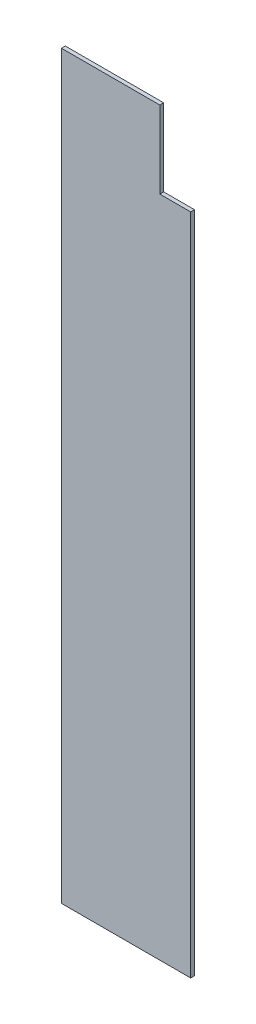
ISO-10303-21;
HEADER;
FILE_DESCRIPTION(('STEP AP214'),'2;1');
FILE_NAME('part.step','',(''),(''),'','','');
FILE_SCHEMA(('AUTOMOTIVE_DESIGN { 1 0 10303 214 1 1 1 1 }'));
ENDSEC;
DATA;
#1=APPLICATION_CONTEXT('core data for automotive mechanical design processes');
#2=APPLICATION_PROTOCOL_DEFINITION('international standard','automotive_design',2000,#1);
#3=PRODUCT_CONTEXT('',#1,'mechanical');
#4=PRODUCT('Part','Part','',(#3));
#5=PRODUCT_RELATED_PRODUCT_CATEGORY('part','',(#4));
#6=PRODUCT_DEFINITION_FORMATION('','',#4);
#7=PRODUCT_DEFINITION_CONTEXT('part definition',#1,'design');
#8=PRODUCT_DEFINITION('design','',#6,#7);
#9=PRODUCT_DEFINITION_SHAPE('','',#8);
#10=(LENGTH_UNIT() NAMED_UNIT(*) SI_UNIT(.MILLI.,.METRE.));
#11=(NAMED_UNIT(*) PLANE_ANGLE_UNIT() SI_UNIT($,.RADIAN.));
#12=(NAMED_UNIT(*) SI_UNIT($,.STERADIAN.) SOLID_ANGLE_UNIT());
#13=UNCERTAINTY_MEASURE_WITH_UNIT(LENGTH_MEASURE(1.E-05),#10,'distance_accuracy_value','');
#14=(GEOMETRIC_REPRESENTATION_CONTEXT(3) GLOBAL_UNCERTAINTY_ASSIGNED_CONTEXT((#13)) GLOBAL_UNIT_ASSIGNED_CONTEXT((#10,
#11,#12)) REPRESENTATION_CONTEXT('',''));
#15=CARTESIAN_POINT('',(0.,0.,0.));
#16=DIRECTION('',(0.,0.,1.));
#17=DIRECTION('',(1.,0.,0.));
#18=AXIS2_PLACEMENT_3D('',#15,#16,#17);
#19=CARTESIAN_POINT('',(168.275000000002,1219.2,6.35));
#20=DIRECTION('',(1.,0.,0.));
#21=DIRECTION('',(0.,0.,-1.));
#22=AXIS2_PLACEMENT_3D('',#19,#20,#21);
#23=PLANE('',#22);
#24=DIRECTION('',(0.,-1.,0.));
#25=VECTOR('',#24,1.);
#26=CARTESIAN_POINT('',(168.275000000002,1219.2,0.));
#27=LINE('',#26,#25);
#28=CARTESIAN_POINT('',(168.275000000002,1219.2,0.));
#29=VERTEX_POINT('',#28);
#30=CARTESIAN_POINT('',(168.275000000002,0.,0.));
#31=VERTEX_POINT('',#30);
#32=EDGE_CURVE('E122',#29,#31,#27,.T.);
#33=ORIENTED_EDGE('',*,*,#32,.T.);
#34=DIRECTION('',(0.,0.,-1.));
#35=VECTOR('',#34,1.);
#36=CARTESIAN_POINT('',(168.275000000002,0.,6.35));
#37=LINE('',#36,#35);
#38=CARTESIAN_POINT('',(168.275000000002,0.,6.35));
#39=VERTEX_POINT('',#38);
#40=EDGE_CURVE('E11',#39,#31,#37,.T.);
#41=ORIENTED_EDGE('',*,*,#40,.F.);
#42=DIRECTION('',(0.,-1.,0.));
#43=VECTOR('',#42,1.);
#44=CARTESIAN_POINT('',(168.275000000002,1219.2,6.35));
#45=LINE('',#44,#43);
#46=CARTESIAN_POINT('',(168.275000000002,1219.2,6.35));
#47=VERTEX_POINT('',#46);
#48=EDGE_CURVE('E132',#47,#39,#45,.T.);
#49=ORIENTED_EDGE('',*,*,#48,.F.);
#50=DIRECTION('',(0.,0.,-1.));
#51=VECTOR('',#50,1.);
#52=CARTESIAN_POINT('',(168.275000000002,1219.2,6.35));
#53=LINE('',#52,#51);
#54=EDGE_CURVE('E118',#47,#29,#53,.T.);
#55=ORIENTED_EDGE('',*,*,#54,.T.);
#56=EDGE_LOOP('',(#33,#41,#49,#55));
#57=FACE_BOUND('',#56,.T.);
#58=ADVANCED_FACE('F38',(#57),#23,.F.);
#59=CARTESIAN_POINT('',(381.000000000002,-2.22044604925031E-13,6.35));
#60=DIRECTION('',(0.,1.,0.));
#61=DIRECTION('',(-1.,0.,0.));
#62=AXIS2_PLACEMENT_3D('',#59,#60,#61);
#63=PLANE('',#62);
#64=DIRECTION('',(1.,0.,0.));
#65=VECTOR('',#64,1.);
#66=CARTESIAN_POINT('',(381.000000000002,-2.22044604925031E-13,0.));
#67=LINE('',#66,#65);
#68=CARTESIAN_POINT('',(381.000000000002,-2.22044604925031E-13,0.));
#69=VERTEX_POINT('',#68);
#70=EDGE_CURVE('E125',#31,#69,#67,.T.);
#71=ORIENTED_EDGE('',*,*,#70,.T.);
#72=DIRECTION('',(0.,0.,-1.));
#73=VECTOR('',#72,1.);
#74=CARTESIAN_POINT('',(381.000000000002,-2.22044604925031E-13,6.35));
#75=LINE('',#74,#73);
#76=CARTESIAN_POINT('',(381.000000000002,-2.22044604925031E-13,6.35));
#77=VERTEX_POINT('',#76);
#78=EDGE_CURVE('E46',#77,#69,#75,.T.);
#79=ORIENTED_EDGE('',*,*,#78,.F.);
#80=DIRECTION('',(1.,0.,0.));
#81=VECTOR('',#80,1.);
#82=CARTESIAN_POINT('',(381.000000000002,-2.22044604925031E-13,6.35));
#83=LINE('',#82,#81);
#84=EDGE_CURVE('E91',#39,#77,#83,.T.);
#85=ORIENTED_EDGE('',*,*,#84,.F.);
#86=ORIENTED_EDGE('',*,*,#40,.T.);
#87=EDGE_LOOP('',(#71,#79,#85,#86));
#88=FACE_BOUND('',#87,.T.);
#89=ADVANCED_FACE('F156',(#88),#63,.F.);
#90=CARTESIAN_POINT('',(381.000000000002,-2.22044604925031E-13,6.35));
#91=DIRECTION('',(-1.,0.,0.));
#92=DIRECTION('',(0.,0.,1.));
#93=AXIS2_PLACEMENT_3D('',#90,#91,#92);
#94=PLANE('',#93);
#95=DIRECTION('',(0.,1.,0.));
#96=VECTOR('',#95,1.);
#97=CARTESIAN_POINT('',(381.000000000002,-2.22044604925031E-13,0.));
#98=LINE('',#97,#96);
#99=CARTESIAN_POINT('',(381.000000000002,1092.2,0.));
#100=VERTEX_POINT('',#99);
#101=EDGE_CURVE('E127',#69,#100,#98,.T.);
#102=ORIENTED_EDGE('',*,*,#101,.T.);
#103=DIRECTION('',(0.,0.,-1.));
#104=VECTOR('',#103,1.);
#105=CARTESIAN_POINT('',(381.000000000002,1092.2,6.35));
#106=LINE('',#105,#104);
#107=CARTESIAN_POINT('',(381.000000000002,1092.2,6.35));
#108=VERTEX_POINT('',#107);
#109=EDGE_CURVE('E113',#108,#100,#106,.T.);
#110=ORIENTED_EDGE('',*,*,#109,.F.);
#111=DIRECTION('',(0.,1.,0.));
#112=VECTOR('',#111,1.);
#113=CARTESIAN_POINT('',(381.000000000002,-2.22044604925031E-13,6.35));
#114=LINE('',#113,#112);
#115=EDGE_CURVE('E104',#77,#108,#114,.T.);
#116=ORIENTED_EDGE('',*,*,#115,.F.);
#117=ORIENTED_EDGE('',*,*,#78,.T.);
#118=EDGE_LOOP('',(#102,#110,#116,#117));
#119=FACE_BOUND('',#118,.T.);
#120=ADVANCED_FACE('F138',(#119),#94,.F.);
#121=CARTESIAN_POINT('',(381.000000000002,1092.2,6.35));
#122=DIRECTION('',(0.,-1.,0.));
#123=DIRECTION('',(0.,0.,-1.));
#124=AXIS2_PLACEMENT_3D('',#121,#122,#123);
#125=PLANE('',#124);
#126=DIRECTION('',(-1.,0.,0.));
#127=VECTOR('',#126,1.);
#128=CARTESIAN_POINT('',(381.000000000002,1092.2,0.));
#129=LINE('',#128,#127);
#130=CARTESIAN_POINT('',(330.200000000002,1092.2,0.));
#131=VERTEX_POINT('',#130);
#132=EDGE_CURVE('E112',#100,#131,#129,.T.);
#133=ORIENTED_EDGE('',*,*,#132,.T.);
#134=DIRECTION('',(0.,0.,-1.));
#135=VECTOR('',#134,1.);
#136=CARTESIAN_POINT('',(330.200000000002,1092.2,6.35));
#137=LINE('',#136,#135);
#138=CARTESIAN_POINT('',(330.200000000002,1092.2,6.35));
#139=VERTEX_POINT('',#138);
#140=EDGE_CURVE('E109',#139,#131,#137,.T.);
#141=ORIENTED_EDGE('',*,*,#140,.F.);
#142=DIRECTION('',(-1.,0.,0.));
#143=VECTOR('',#142,1.);
#144=CARTESIAN_POINT('',(381.000000000002,1092.2,6.35));
#145=LINE('',#144,#143);
#146=EDGE_CURVE('E98',#108,#139,#145,.T.);
#147=ORIENTED_EDGE('',*,*,#146,.F.);
#148=ORIENTED_EDGE('',*,*,#109,.T.);
#149=EDGE_LOOP('',(#133,#141,#147,#148));
#150=FACE_BOUND('',#149,.T.);
#151=ADVANCED_FACE('F110',(#150),#125,.F.);
#152=CARTESIAN_POINT('',(330.200000000002,1219.2,6.35));
#153=DIRECTION('',(-1.,0.,0.));
#154=DIRECTION('',(0.,0.,1.));
#155=AXIS2_PLACEMENT_3D('',#152,#153,#154);
#156=PLANE('',#155);
#157=DIRECTION('',(0.,1.,0.));
#158=VECTOR('',#157,1.);
#159=CARTESIAN_POINT('',(330.200000000002,1219.2,0.));
#160=LINE('',#159,#158);
#161=CARTESIAN_POINT('',(330.200000000002,1219.2,0.));
#162=VERTEX_POINT('',#161);
#163=EDGE_CURVE('E77',#131,#162,#160,.T.);
#164=ORIENTED_EDGE('',*,*,#163,.T.);
#165=DIRECTION('',(0.,0.,-1.));
#166=VECTOR('',#165,1.);
#167=CARTESIAN_POINT('',(330.200000000002,1219.2,6.35));
#168=LINE('',#167,#166);
#169=CARTESIAN_POINT('',(330.200000000002,1219.2,6.35));
#170=VERTEX_POINT('',#169);
#171=EDGE_CURVE('E114',#170,#162,#168,.T.);
#172=ORIENTED_EDGE('',*,*,#171,.F.);
#173=DIRECTION('',(0.,1.,0.));
#174=VECTOR('',#173,1.);
#175=CARTESIAN_POINT('',(330.200000000002,1219.2,6.35));
#176=LINE('',#175,#174);
#177=EDGE_CURVE('E102',#139,#170,#176,.T.);
#178=ORIENTED_EDGE('',*,*,#177,.F.);
#179=ORIENTED_EDGE('',*,*,#140,.T.);
#180=EDGE_LOOP('',(#164,#172,#178,#179));
#181=FACE_BOUND('',#180,.T.);
#182=ADVANCED_FACE('F116',(#181),#156,.F.);
#183=CARTESIAN_POINT('',(168.275000000002,1219.2,6.35));
#184=DIRECTION('',(0.,-1.,0.));
#185=DIRECTION('',(0.,0.,-1.));
#186=AXIS2_PLACEMENT_3D('',#183,#184,#185);
#187=PLANE('',#186);
#188=DIRECTION('',(-1.,0.,0.));
#189=VECTOR('',#188,1.);
#190=CARTESIAN_POINT('',(168.275000000002,1219.2,0.));
#191=LINE('',#190,#189);
#192=EDGE_CURVE('E83',#162,#29,#191,.T.);
#193=ORIENTED_EDGE('',*,*,#192,.T.);
#194=ORIENTED_EDGE('',*,*,#54,.F.);
#195=DIRECTION('',(-1.,0.,0.));
#196=VECTOR('',#195,1.);
#197=CARTESIAN_POINT('',(168.275000000002,1219.2,6.35));
#198=LINE('',#197,#196);
#199=EDGE_CURVE('E54',#170,#47,#198,.T.);
#200=ORIENTED_EDGE('',*,*,#199,.F.);
#201=ORIENTED_EDGE('',*,*,#171,.T.);
#202=EDGE_LOOP('',(#193,#194,#200,#201));
#203=FACE_BOUND('',#202,.T.);
#204=ADVANCED_FACE('F145',(#203),#187,.F.);
#205=CARTESIAN_POINT('',(0.,0.,6.35));
#206=DIRECTION('',(0.,0.,-1.));
#207=DIRECTION('',(-1.,0.,0.));
#208=AXIS2_PLACEMENT_3D('',#205,#206,#207);
#209=PLANE('',#208);
#210=ORIENTED_EDGE('',*,*,#48,.T.);
#211=ORIENTED_EDGE('',*,*,#84,.T.);
#212=ORIENTED_EDGE('',*,*,#115,.T.);
#213=ORIENTED_EDGE('',*,*,#146,.T.);
#214=ORIENTED_EDGE('',*,*,#177,.T.);
#215=ORIENTED_EDGE('',*,*,#199,.T.);
#216=EDGE_LOOP('',(#210,#211,#212,#213,#214,#215));
#217=FACE_BOUND('',#216,.T.);
#218=ADVANCED_FACE('F100',(#217),#209,.F.);
#219=CARTESIAN_POINT('',(0.,0.,0.));
#220=DIRECTION('',(0.,0.,-1.));
#221=DIRECTION('',(-1.,0.,0.));
#222=AXIS2_PLACEMENT_3D('',#219,#220,#221);
#223=PLANE('',#222);
#224=ORIENTED_EDGE('',*,*,#32,.F.);
#225=ORIENTED_EDGE('',*,*,#192,.F.);
#226=ORIENTED_EDGE('',*,*,#163,.F.);
#227=ORIENTED_EDGE('',*,*,#132,.F.);
#228=ORIENTED_EDGE('',*,*,#101,.F.);
#229=ORIENTED_EDGE('',*,*,#70,.F.);
#230=EDGE_LOOP('',(#224,#225,#226,#227,#228,#229));
#231=FACE_BOUND('',#230,.T.);
#232=ADVANCED_FACE('F141',(#231),#223,.T.);
#233=CLOSED_SHELL('',(#58,#89,#120,#151,#182,#204,#218,#232));
#234=MANIFOLD_SOLID_BREP('B2',#233);
#235=ADVANCED_BREP_SHAPE_REPRESENTATION('',(#18,#234),#14);
#236=SHAPE_DEFINITION_REPRESENTATION(#9,#235);
ENDSEC;
END-ISO-10303-21;
